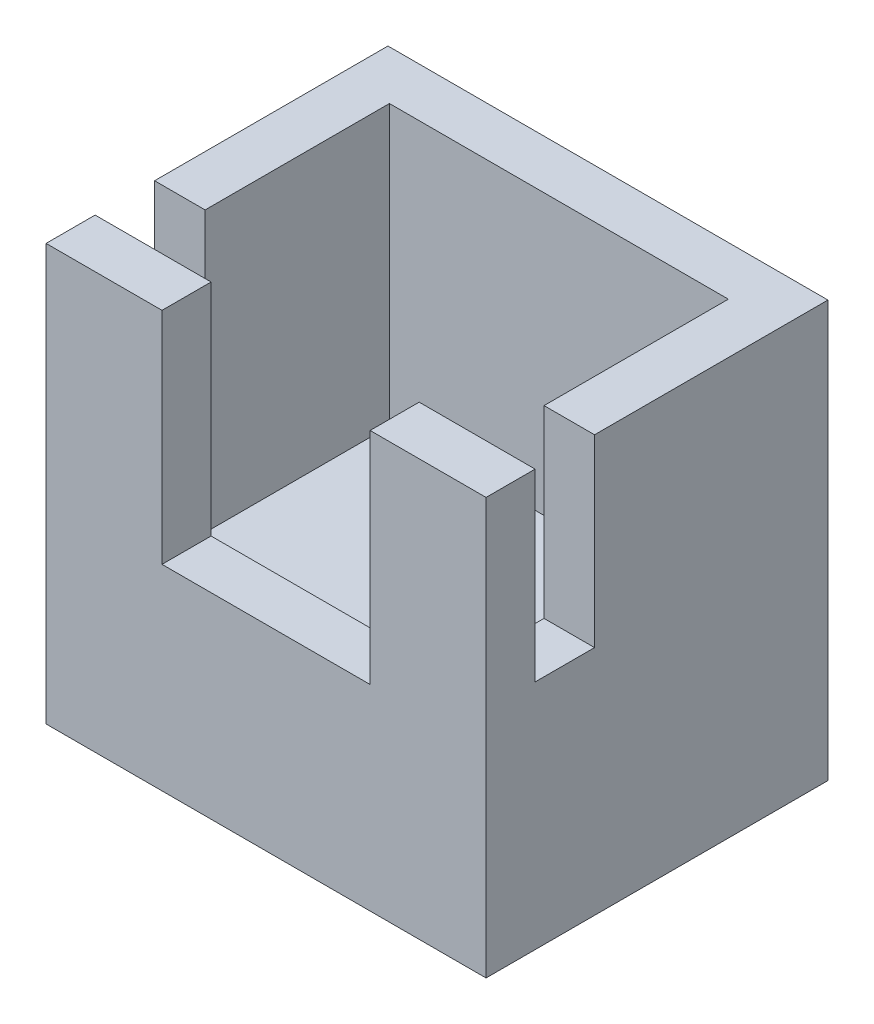
ISO-10303-21;
HEADER;
FILE_DESCRIPTION(('STEP AP214'),'2;1');
FILE_NAME('part.step','',(''),(''),'','','');
FILE_SCHEMA(('AUTOMOTIVE_DESIGN { 1 0 10303 214 1 1 1 1 }'));
ENDSEC;
DATA;
#1=APPLICATION_CONTEXT('core data for automotive mechanical design processes');
#2=APPLICATION_PROTOCOL_DEFINITION('international standard','automotive_design',2000,#1);
#3=PRODUCT_CONTEXT('',#1,'mechanical');
#4=PRODUCT('Part','Part','',(#3));
#5=PRODUCT_RELATED_PRODUCT_CATEGORY('part','',(#4));
#6=PRODUCT_DEFINITION_FORMATION('','',#4);
#7=PRODUCT_DEFINITION_CONTEXT('part definition',#1,'design');
#8=PRODUCT_DEFINITION('design','',#6,#7);
#9=PRODUCT_DEFINITION_SHAPE('','',#8);
#10=(LENGTH_UNIT() NAMED_UNIT(*) SI_UNIT(.MILLI.,.METRE.));
#11=(NAMED_UNIT(*) PLANE_ANGLE_UNIT() SI_UNIT($,.RADIAN.));
#12=(NAMED_UNIT(*) SI_UNIT($,.STERADIAN.) SOLID_ANGLE_UNIT());
#13=UNCERTAINTY_MEASURE_WITH_UNIT(LENGTH_MEASURE(1.E-05),#10,'distance_accuracy_value','');
#14=(GEOMETRIC_REPRESENTATION_CONTEXT(3) GLOBAL_UNCERTAINTY_ASSIGNED_CONTEXT((#13)) GLOBAL_UNIT_ASSIGNED_CONTEXT((#10,
#11,#12)) REPRESENTATION_CONTEXT('',''));
#15=CARTESIAN_POINT('',(0.,0.,0.));
#16=DIRECTION('',(0.,0.,1.));
#17=DIRECTION('',(1.,0.,0.));
#18=AXIS2_PLACEMENT_3D('',#15,#16,#17);
#19=CARTESIAN_POINT('',(3.7,7.,-2.875));
#20=DIRECTION('',(0.,1.,0.));
#21=DIRECTION('',(0.,0.,1.));
#22=AXIS2_PLACEMENT_3D('',#19,#20,#21);
#23=PLANE('',#22);
#24=DIRECTION('',(0.,0.,-1.));
#25=VECTOR('',#24,1.);
#26=CARTESIAN_POINT('',(-1.75,7.,2.875));
#27=LINE('',#26,#25);
#28=CARTESIAN_POINT('',(-1.75,7.,2.875));
#29=VERTEX_POINT('',#28);
#30=CARTESIAN_POINT('',(-1.75,7.,2.05));
#31=VERTEX_POINT('',#30);
#32=EDGE_CURVE('E11',#29,#31,#27,.T.);
#33=ORIENTED_EDGE('',*,*,#32,.T.);
#34=DIRECTION('',(-1.,0.,0.));
#35=VECTOR('',#34,1.);
#36=CARTESIAN_POINT('',(3.7,7.,2.05));
#37=LINE('',#36,#35);
#38=CARTESIAN_POINT('',(-3.7,7.,2.05));
#39=VERTEX_POINT('',#38);
#40=EDGE_CURVE('E24',#31,#39,#37,.T.);
#41=ORIENTED_EDGE('',*,*,#40,.T.);
#42=DIRECTION('',(0.,0.,1.));
#43=VECTOR('',#42,1.);
#44=CARTESIAN_POINT('',(-3.7,7.,-2.875));
#45=LINE('',#44,#43);
#46=CARTESIAN_POINT('',(-3.7,7.,2.875));
#47=VERTEX_POINT('',#46);
#48=EDGE_CURVE('E291',#39,#47,#45,.T.);
#49=ORIENTED_EDGE('',*,*,#48,.T.);
#50=DIRECTION('',(-1.,0.,0.));
#51=VECTOR('',#50,1.);
#52=CARTESIAN_POINT('',(3.7,7.,2.875));
#53=LINE('',#52,#51);
#54=EDGE_CURVE('E288',#29,#47,#53,.T.);
#55=ORIENTED_EDGE('',*,*,#54,.F.);
#56=EDGE_LOOP('',(#33,#41,#49,#55));
#57=FACE_BOUND('',#56,.T.);
#58=ADVANCED_FACE('F17',(#57),#23,.T.);
#59=CARTESIAN_POINT('',(3.7,7.,1.05));
#60=DIRECTION('',(0.,0.,-1.));
#61=DIRECTION('',(-1.,0.,0.));
#62=AXIS2_PLACEMENT_3D('',#59,#60,#61);
#63=PLANE('',#62);
#64=DIRECTION('',(-1.,0.,0.));
#65=VECTOR('',#64,1.);
#66=CARTESIAN_POINT('',(3.7,7.,1.05));
#67=LINE('',#66,#65);
#68=CARTESIAN_POINT('',(3.7,7.,1.05));
#69=VERTEX_POINT('',#68);
#70=CARTESIAN_POINT('',(2.85,7.,1.05));
#71=VERTEX_POINT('',#70);
#72=EDGE_CURVE('E286',#69,#71,#67,.T.);
#73=ORIENTED_EDGE('',*,*,#72,.T.);
#74=DIRECTION('',(0.,1.,0.));
#75=VECTOR('',#74,1.);
#76=CARTESIAN_POINT('',(2.85,2.3,1.05));
#77=LINE('',#76,#75);
#78=CARTESIAN_POINT('',(2.85,3.9,1.05));
#79=VERTEX_POINT('',#78);
#80=EDGE_CURVE('E283',#79,#71,#77,.T.);
#81=ORIENTED_EDGE('',*,*,#80,.F.);
#82=DIRECTION('',(-1.,0.,0.));
#83=VECTOR('',#82,1.);
#84=CARTESIAN_POINT('',(3.7,3.9,1.05));
#85=LINE('',#84,#83);
#86=CARTESIAN_POINT('',(3.7,3.9,1.05));
#87=VERTEX_POINT('',#86);
#88=EDGE_CURVE('E280',#87,#79,#85,.T.);
#89=ORIENTED_EDGE('',*,*,#88,.F.);
#90=DIRECTION('',(0.,-1.,0.));
#91=VECTOR('',#90,1.);
#92=CARTESIAN_POINT('',(3.7,7.,1.05));
#93=LINE('',#92,#91);
#94=EDGE_CURVE('E277',#69,#87,#93,.T.);
#95=ORIENTED_EDGE('',*,*,#94,.F.);
#96=EDGE_LOOP('',(#73,#81,#89,#95));
#97=FACE_BOUND('',#96,.T.);
#98=ADVANCED_FACE('F343',(#97),#63,.F.);
#99=CARTESIAN_POINT('',(3.7,3.9,1.05));
#100=DIRECTION('',(0.,-1.,0.));
#101=DIRECTION('',(0.,0.,-1.));
#102=AXIS2_PLACEMENT_3D('',#99,#100,#101);
#103=PLANE('',#102);
#104=ORIENTED_EDGE('',*,*,#88,.T.);
#105=DIRECTION('',(0.,0.,-1.));
#106=VECTOR('',#105,1.);
#107=CARTESIAN_POINT('',(2.85,3.9,2.05));
#108=LINE('',#107,#106);
#109=CARTESIAN_POINT('',(2.85,3.9,2.05));
#110=VERTEX_POINT('',#109);
#111=EDGE_CURVE('E274',#110,#79,#108,.T.);
#112=ORIENTED_EDGE('',*,*,#111,.F.);
#113=DIRECTION('',(-1.,0.,0.));
#114=VECTOR('',#113,1.);
#115=CARTESIAN_POINT('',(3.7,3.9,2.05));
#116=LINE('',#115,#114);
#117=CARTESIAN_POINT('',(3.7,3.9,2.05));
#118=VERTEX_POINT('',#117);
#119=EDGE_CURVE('E271',#118,#110,#116,.T.);
#120=ORIENTED_EDGE('',*,*,#119,.F.);
#121=DIRECTION('',(0.,0.,1.));
#122=VECTOR('',#121,1.);
#123=CARTESIAN_POINT('',(3.7,3.9,1.05));
#124=LINE('',#123,#122);
#125=EDGE_CURVE('E268',#87,#118,#124,.T.);
#126=ORIENTED_EDGE('',*,*,#125,.F.);
#127=EDGE_LOOP('',(#104,#112,#120,#126));
#128=FACE_BOUND('',#127,.T.);
#129=ADVANCED_FACE('F339',(#128),#103,.F.);
#130=CARTESIAN_POINT('',(3.7,7.,-2.875));
#131=DIRECTION('',(0.,1.,0.));
#132=DIRECTION('',(0.,0.,1.));
#133=AXIS2_PLACEMENT_3D('',#130,#131,#132);
#134=PLANE('',#133);
#135=DIRECTION('',(0.,0.,-1.));
#136=VECTOR('',#135,1.);
#137=CARTESIAN_POINT('',(1.75,7.,2.875));
#138=LINE('',#137,#136);
#139=CARTESIAN_POINT('',(1.75,7.,2.875));
#140=VERTEX_POINT('',#139);
#141=CARTESIAN_POINT('',(1.75,7.,2.05));
#142=VERTEX_POINT('',#141);
#143=EDGE_CURVE('E266',#140,#142,#138,.T.);
#144=ORIENTED_EDGE('',*,*,#143,.F.);
#145=DIRECTION('',(-1.,0.,0.));
#146=VECTOR('',#145,1.);
#147=CARTESIAN_POINT('',(3.7,7.,2.875));
#148=LINE('',#147,#146);
#149=CARTESIAN_POINT('',(3.7,7.,2.875));
#150=VERTEX_POINT('',#149);
#151=EDGE_CURVE('E263',#150,#140,#148,.T.);
#152=ORIENTED_EDGE('',*,*,#151,.F.);
#153=DIRECTION('',(0.,0.,1.));
#154=VECTOR('',#153,1.);
#155=CARTESIAN_POINT('',(3.7,7.,-2.875));
#156=LINE('',#155,#154);
#157=CARTESIAN_POINT('',(3.7,7.,2.05));
#158=VERTEX_POINT('',#157);
#159=EDGE_CURVE('E260',#158,#150,#156,.T.);
#160=ORIENTED_EDGE('',*,*,#159,.F.);
#161=DIRECTION('',(-1.,0.,0.));
#162=VECTOR('',#161,1.);
#163=CARTESIAN_POINT('',(3.7,7.,2.05));
#164=LINE('',#163,#162);
#165=EDGE_CURVE('E257',#158,#142,#164,.T.);
#166=ORIENTED_EDGE('',*,*,#165,.T.);
#167=EDGE_LOOP('',(#144,#152,#160,#166));
#168=FACE_BOUND('',#167,.T.);
#169=ADVANCED_FACE('F334',(#168),#134,.T.);
#170=CARTESIAN_POINT('',(-3.7,0.,-2.875));
#171=DIRECTION('',(0.,-1.,0.));
#172=DIRECTION('',(0.,0.,-1.));
#173=AXIS2_PLACEMENT_3D('',#170,#171,#172);
#174=PLANE('',#173);
#175=DIRECTION('',(1.,0.,0.));
#176=VECTOR('',#175,1.);
#177=CARTESIAN_POINT('',(-3.7,0.,2.875));
#178=LINE('',#177,#176);
#179=CARTESIAN_POINT('',(-3.7,0.,2.875));
#180=VERTEX_POINT('',#179);
#181=CARTESIAN_POINT('',(3.7,0.,2.875));
#182=VERTEX_POINT('',#181);
#183=EDGE_CURVE('E255',#180,#182,#178,.T.);
#184=ORIENTED_EDGE('',*,*,#183,.F.);
#185=DIRECTION('',(0.,0.,1.));
#186=VECTOR('',#185,1.);
#187=CARTESIAN_POINT('',(-3.7,0.,-2.875));
#188=LINE('',#187,#186);
#189=CARTESIAN_POINT('',(-3.7,0.,-2.875));
#190=VERTEX_POINT('',#189);
#191=EDGE_CURVE('E252',#190,#180,#188,.T.);
#192=ORIENTED_EDGE('',*,*,#191,.F.);
#193=DIRECTION('',(1.,0.,0.));
#194=VECTOR('',#193,1.);
#195=CARTESIAN_POINT('',(-3.7,0.,-2.875));
#196=LINE('',#195,#194);
#197=CARTESIAN_POINT('',(3.7,0.,-2.875));
#198=VERTEX_POINT('',#197);
#199=EDGE_CURVE('E250',#190,#198,#196,.T.);
#200=ORIENTED_EDGE('',*,*,#199,.T.);
#201=DIRECTION('',(0.,0.,1.));
#202=VECTOR('',#201,1.);
#203=CARTESIAN_POINT('',(3.7,0.,-2.875));
#204=LINE('',#203,#202);
#205=EDGE_CURVE('E247',#198,#182,#204,.T.);
#206=ORIENTED_EDGE('',*,*,#205,.T.);
#207=EDGE_LOOP('',(#184,#192,#200,#206));
#208=FACE_BOUND('',#207,.T.);
#209=ADVANCED_FACE('F318',(#208),#174,.T.);
#210=CARTESIAN_POINT('',(-3.7,7.,-2.875));
#211=DIRECTION('',(-1.,0.,0.));
#212=DIRECTION('',(0.,0.,1.));
#213=AXIS2_PLACEMENT_3D('',#210,#211,#212);
#214=PLANE('',#213);
#215=DIRECTION('',(0.,1.,0.));
#216=VECTOR('',#215,1.);
#217=CARTESIAN_POINT('',(-3.7,3.9,2.05));
#218=LINE('',#217,#216);
#219=CARTESIAN_POINT('',(-3.7,3.9,2.05));
#220=VERTEX_POINT('',#219);
#221=EDGE_CURVE('E244',#220,#39,#218,.T.);
#222=ORIENTED_EDGE('',*,*,#221,.F.);
#223=DIRECTION('',(0.,0.,1.));
#224=VECTOR('',#223,1.);
#225=CARTESIAN_POINT('',(-3.7,3.9,1.05));
#226=LINE('',#225,#224);
#227=CARTESIAN_POINT('',(-3.7,3.9,1.05));
#228=VERTEX_POINT('',#227);
#229=EDGE_CURVE('E241',#228,#220,#226,.T.);
#230=ORIENTED_EDGE('',*,*,#229,.F.);
#231=DIRECTION('',(0.,-1.,0.));
#232=VECTOR('',#231,1.);
#233=CARTESIAN_POINT('',(-3.7,7.,1.05));
#234=LINE('',#233,#232);
#235=CARTESIAN_POINT('',(-3.7,7.,1.05));
#236=VERTEX_POINT('',#235);
#237=EDGE_CURVE('E238',#236,#228,#234,.T.);
#238=ORIENTED_EDGE('',*,*,#237,.F.);
#239=DIRECTION('',(0.,0.,1.));
#240=VECTOR('',#239,1.);
#241=CARTESIAN_POINT('',(-3.7,7.,-2.875));
#242=LINE('',#241,#240);
#243=CARTESIAN_POINT('',(-3.7,7.,-2.875));
#244=VERTEX_POINT('',#243);
#245=EDGE_CURVE('E235',#244,#236,#242,.T.);
#246=ORIENTED_EDGE('',*,*,#245,.F.);
#247=DIRECTION('',(0.,-1.,0.));
#248=VECTOR('',#247,1.);
#249=CARTESIAN_POINT('',(-3.7,7.,-2.875));
#250=LINE('',#249,#248);
#251=EDGE_CURVE('E232',#244,#190,#250,.T.);
#252=ORIENTED_EDGE('',*,*,#251,.T.);
#253=ORIENTED_EDGE('',*,*,#191,.T.);
#254=DIRECTION('',(0.,-1.,0.));
#255=VECTOR('',#254,1.);
#256=CARTESIAN_POINT('',(-3.7,7.,2.875));
#257=LINE('',#256,#255);
#258=EDGE_CURVE('E229',#47,#180,#257,.T.);
#259=ORIENTED_EDGE('',*,*,#258,.F.);
#260=ORIENTED_EDGE('',*,*,#48,.F.);
#261=EDGE_LOOP('',(#222,#230,#238,#246,#252,#253,#259,#260));
#262=FACE_BOUND('',#261,.T.);
#263=ADVANCED_FACE('F296',(#262),#214,.T.);
#264=CARTESIAN_POINT('',(3.7,7.,-2.875));
#265=DIRECTION('',(0.,1.,0.));
#266=DIRECTION('',(0.,0.,1.));
#267=AXIS2_PLACEMENT_3D('',#264,#265,#266);
#268=PLANE('',#267);
#269=DIRECTION('',(0.,0.,1.));
#270=VECTOR('',#269,1.);
#271=CARTESIAN_POINT('',(2.85,7.,-2.05));
#272=LINE('',#271,#270);
#273=CARTESIAN_POINT('',(2.85,7.,-2.05));
#274=VERTEX_POINT('',#273);
#275=EDGE_CURVE('E226',#274,#71,#272,.T.);
#276=ORIENTED_EDGE('',*,*,#275,.T.);
#277=ORIENTED_EDGE('',*,*,#72,.F.);
#278=DIRECTION('',(0.,0.,1.));
#279=VECTOR('',#278,1.);
#280=CARTESIAN_POINT('',(3.7,7.,-2.875));
#281=LINE('',#280,#279);
#282=CARTESIAN_POINT('',(3.7,7.,-2.875));
#283=VERTEX_POINT('',#282);
#284=EDGE_CURVE('E223',#283,#69,#281,.T.);
#285=ORIENTED_EDGE('',*,*,#284,.F.);
#286=DIRECTION('',(-1.,0.,0.));
#287=VECTOR('',#286,1.);
#288=CARTESIAN_POINT('',(3.7,7.,-2.875));
#289=LINE('',#288,#287);
#290=EDGE_CURVE('E220',#283,#244,#289,.T.);
#291=ORIENTED_EDGE('',*,*,#290,.T.);
#292=ORIENTED_EDGE('',*,*,#245,.T.);
#293=DIRECTION('',(-1.,0.,0.));
#294=VECTOR('',#293,1.);
#295=CARTESIAN_POINT('',(3.7,7.,1.05));
#296=LINE('',#295,#294);
#297=CARTESIAN_POINT('',(-2.85,7.,1.05));
#298=VERTEX_POINT('',#297);
#299=EDGE_CURVE('E217',#298,#236,#296,.T.);
#300=ORIENTED_EDGE('',*,*,#299,.F.);
#301=DIRECTION('',(0.,0.,1.));
#302=VECTOR('',#301,1.);
#303=CARTESIAN_POINT('',(-2.85,7.,-2.05));
#304=LINE('',#303,#302);
#305=CARTESIAN_POINT('',(-2.85,7.,-2.05));
#306=VERTEX_POINT('',#305);
#307=EDGE_CURVE('E215',#306,#298,#304,.T.);
#308=ORIENTED_EDGE('',*,*,#307,.F.);
#309=DIRECTION('',(-1.,0.,0.));
#310=VECTOR('',#309,1.);
#311=CARTESIAN_POINT('',(2.85,7.,-2.05));
#312=LINE('',#311,#310);
#313=EDGE_CURVE('E157',#274,#306,#312,.T.);
#314=ORIENTED_EDGE('',*,*,#313,.F.);
#315=EDGE_LOOP('',(#276,#277,#285,#291,#292,#300,#308,#314));
#316=FACE_BOUND('',#315,.T.);
#317=ADVANCED_FACE('F307',(#316),#268,.T.);
#318=CARTESIAN_POINT('',(3.7,0.,-2.875));
#319=DIRECTION('',(1.,0.,0.));
#320=DIRECTION('',(0.,0.,-1.));
#321=AXIS2_PLACEMENT_3D('',#318,#319,#320);
#322=PLANE('',#321);
#323=DIRECTION('',(0.,1.,0.));
#324=VECTOR('',#323,1.);
#325=CARTESIAN_POINT('',(3.7,3.9,2.05));
#326=LINE('',#325,#324);
#327=EDGE_CURVE('E211',#118,#158,#326,.T.);
#328=ORIENTED_EDGE('',*,*,#327,.T.);
#329=ORIENTED_EDGE('',*,*,#159,.T.);
#330=DIRECTION('',(0.,1.,0.));
#331=VECTOR('',#330,1.);
#332=CARTESIAN_POINT('',(3.7,0.,2.875));
#333=LINE('',#332,#331);
#334=EDGE_CURVE('E208',#182,#150,#333,.T.);
#335=ORIENTED_EDGE('',*,*,#334,.F.);
#336=ORIENTED_EDGE('',*,*,#205,.F.);
#337=DIRECTION('',(0.,1.,0.));
#338=VECTOR('',#337,1.);
#339=CARTESIAN_POINT('',(3.7,0.,-2.875));
#340=LINE('',#339,#338);
#341=EDGE_CURVE('E205',#198,#283,#340,.T.);
#342=ORIENTED_EDGE('',*,*,#341,.T.);
#343=ORIENTED_EDGE('',*,*,#284,.T.);
#344=ORIENTED_EDGE('',*,*,#94,.T.);
#345=ORIENTED_EDGE('',*,*,#125,.T.);
#346=EDGE_LOOP('',(#328,#329,#335,#336,#342,#343,#344,#345));
#347=FACE_BOUND('',#346,.T.);
#348=ADVANCED_FACE('F315',(#347),#322,.T.);
#349=CARTESIAN_POINT('',(0.,0.,-2.875));
#350=DIRECTION('',(0.,0.,1.));
#351=DIRECTION('',(1.,0.,0.));
#352=AXIS2_PLACEMENT_3D('',#349,#350,#351);
#353=PLANE('',#352);
#354=ORIENTED_EDGE('',*,*,#199,.F.);
#355=ORIENTED_EDGE('',*,*,#251,.F.);
#356=ORIENTED_EDGE('',*,*,#290,.F.);
#357=ORIENTED_EDGE('',*,*,#341,.F.);
#358=EDGE_LOOP('',(#354,#355,#356,#357));
#359=FACE_BOUND('',#358,.T.);
#360=ADVANCED_FACE('F312',(#359),#353,.F.);
#361=CARTESIAN_POINT('',(0.,0.,2.875));
#362=DIRECTION('',(0.,0.,1.));
#363=DIRECTION('',(1.,0.,0.));
#364=AXIS2_PLACEMENT_3D('',#361,#362,#363);
#365=PLANE('',#364);
#366=DIRECTION('',(0.,1.,0.));
#367=VECTOR('',#366,1.);
#368=CARTESIAN_POINT('',(-1.75,3.3,2.875));
#369=LINE('',#368,#367);
#370=CARTESIAN_POINT('',(-1.75,3.3,2.875));
#371=VERTEX_POINT('',#370);
#372=EDGE_CURVE('E202',#371,#29,#369,.T.);
#373=ORIENTED_EDGE('',*,*,#372,.T.);
#374=ORIENTED_EDGE('',*,*,#54,.T.);
#375=ORIENTED_EDGE('',*,*,#258,.T.);
#376=ORIENTED_EDGE('',*,*,#183,.T.);
#377=ORIENTED_EDGE('',*,*,#334,.T.);
#378=ORIENTED_EDGE('',*,*,#151,.T.);
#379=DIRECTION('',(0.,-1.,0.));
#380=VECTOR('',#379,1.);
#381=CARTESIAN_POINT('',(1.75,7.,2.875));
#382=LINE('',#381,#380);
#383=CARTESIAN_POINT('',(1.75,3.3,2.875));
#384=VERTEX_POINT('',#383);
#385=EDGE_CURVE('E200',#140,#384,#382,.T.);
#386=ORIENTED_EDGE('',*,*,#385,.T.);
#387=DIRECTION('',(-1.,0.,0.));
#388=VECTOR('',#387,1.);
#389=CARTESIAN_POINT('',(1.75,3.3,2.875));
#390=LINE('',#389,#388);
#391=EDGE_CURVE('E197',#384,#371,#390,.T.);
#392=ORIENTED_EDGE('',*,*,#391,.T.);
#393=EDGE_LOOP('',(#373,#374,#375,#376,#377,#378,#386,#392));
#394=FACE_BOUND('',#393,.T.);
#395=ADVANCED_FACE('F320',(#394),#365,.T.);
#396=CARTESIAN_POINT('',(3.7,3.9,2.05));
#397=DIRECTION('',(0.,0.,1.));
#398=DIRECTION('',(0.,-1.,0.));
#399=AXIS2_PLACEMENT_3D('',#396,#397,#398);
#400=PLANE('',#399);
#401=ORIENTED_EDGE('',*,*,#40,.F.);
#402=DIRECTION('',(0.,1.,0.));
#403=VECTOR('',#402,1.);
#404=CARTESIAN_POINT('',(-1.75,3.3,2.05));
#405=LINE('',#404,#403);
#406=CARTESIAN_POINT('',(-1.75,3.3,2.05));
#407=VERTEX_POINT('',#406);
#408=EDGE_CURVE('E195',#407,#31,#405,.T.);
#409=ORIENTED_EDGE('',*,*,#408,.F.);
#410=DIRECTION('',(-1.,0.,0.));
#411=VECTOR('',#410,1.);
#412=CARTESIAN_POINT('',(1.75,3.3,2.05));
#413=LINE('',#412,#411);
#414=CARTESIAN_POINT('',(1.75,3.3,2.05));
#415=VERTEX_POINT('',#414);
#416=EDGE_CURVE('E192',#415,#407,#413,.T.);
#417=ORIENTED_EDGE('',*,*,#416,.F.);
#418=DIRECTION('',(0.,-1.,0.));
#419=VECTOR('',#418,1.);
#420=CARTESIAN_POINT('',(1.75,7.,2.05));
#421=LINE('',#420,#419);
#422=EDGE_CURVE('E189',#142,#415,#421,.T.);
#423=ORIENTED_EDGE('',*,*,#422,.F.);
#424=ORIENTED_EDGE('',*,*,#165,.F.);
#425=ORIENTED_EDGE('',*,*,#327,.F.);
#426=ORIENTED_EDGE('',*,*,#119,.T.);
#427=DIRECTION('',(0.,1.,0.));
#428=VECTOR('',#427,1.);
#429=CARTESIAN_POINT('',(2.85,2.3,2.05));
#430=LINE('',#429,#428);
#431=CARTESIAN_POINT('',(2.85,2.3,2.05));
#432=VERTEX_POINT('',#431);
#433=EDGE_CURVE('E186',#432,#110,#430,.T.);
#434=ORIENTED_EDGE('',*,*,#433,.F.);
#435=DIRECTION('',(1.,0.,0.));
#436=VECTOR('',#435,1.);
#437=CARTESIAN_POINT('',(-2.85,2.3,2.05));
#438=LINE('',#437,#436);
#439=CARTESIAN_POINT('',(-2.85,2.3,2.05));
#440=VERTEX_POINT('',#439);
#441=EDGE_CURVE('E184',#440,#432,#438,.T.);
#442=ORIENTED_EDGE('',*,*,#441,.F.);
#443=DIRECTION('',(0.,1.,0.));
#444=VECTOR('',#443,1.);
#445=CARTESIAN_POINT('',(-2.85,2.3,2.05));
#446=LINE('',#445,#444);
#447=CARTESIAN_POINT('',(-2.85,3.9,2.05));
#448=VERTEX_POINT('',#447);
#449=EDGE_CURVE('E144',#440,#448,#446,.T.);
#450=ORIENTED_EDGE('',*,*,#449,.T.);
#451=DIRECTION('',(-1.,0.,0.));
#452=VECTOR('',#451,1.);
#453=CARTESIAN_POINT('',(3.7,3.9,2.05));
#454=LINE('',#453,#452);
#455=EDGE_CURVE('E180',#448,#220,#454,.T.);
#456=ORIENTED_EDGE('',*,*,#455,.T.);
#457=ORIENTED_EDGE('',*,*,#221,.T.);
#458=EDGE_LOOP('',(#401,#409,#417,#423,#424,#425,#426,#434,#442,#450,#456,#457));
#459=FACE_BOUND('',#458,.T.);
#460=ADVANCED_FACE('F297',(#459),#400,.F.);
#461=CARTESIAN_POINT('',(3.7,3.9,1.05));
#462=DIRECTION('',(0.,-1.,0.));
#463=DIRECTION('',(0.,0.,-1.));
#464=AXIS2_PLACEMENT_3D('',#461,#462,#463);
#465=PLANE('',#464);
#466=ORIENTED_EDGE('',*,*,#455,.F.);
#467=DIRECTION('',(0.,0.,1.));
#468=VECTOR('',#467,1.);
#469=CARTESIAN_POINT('',(-2.85,3.9,1.05));
#470=LINE('',#469,#468);
#471=CARTESIAN_POINT('',(-2.85,3.9,1.05));
#472=VERTEX_POINT('',#471);
#473=EDGE_CURVE('E178',#472,#448,#470,.T.);
#474=ORIENTED_EDGE('',*,*,#473,.F.);
#475=DIRECTION('',(-1.,0.,0.));
#476=VECTOR('',#475,1.);
#477=CARTESIAN_POINT('',(3.7,3.9,1.05));
#478=LINE('',#477,#476);
#479=EDGE_CURVE('E175',#472,#228,#478,.T.);
#480=ORIENTED_EDGE('',*,*,#479,.T.);
#481=ORIENTED_EDGE('',*,*,#229,.T.);
#482=EDGE_LOOP('',(#466,#474,#480,#481));
#483=FACE_BOUND('',#482,.T.);
#484=ADVANCED_FACE('F300',(#483),#465,.F.);
#485=CARTESIAN_POINT('',(3.7,7.,1.05));
#486=DIRECTION('',(0.,0.,-1.));
#487=DIRECTION('',(-1.,0.,0.));
#488=AXIS2_PLACEMENT_3D('',#485,#486,#487);
#489=PLANE('',#488);
#490=ORIENTED_EDGE('',*,*,#479,.F.);
#491=DIRECTION('',(0.,-1.,0.));
#492=VECTOR('',#491,1.);
#493=CARTESIAN_POINT('',(-2.85,7.,1.05));
#494=LINE('',#493,#492);
#495=EDGE_CURVE('E172',#298,#472,#494,.T.);
#496=ORIENTED_EDGE('',*,*,#495,.F.);
#497=ORIENTED_EDGE('',*,*,#299,.T.);
#498=ORIENTED_EDGE('',*,*,#237,.T.);
#499=EDGE_LOOP('',(#490,#496,#497,#498));
#500=FACE_BOUND('',#499,.T.);
#501=ADVANCED_FACE('F304',(#500),#489,.F.);
#502=CARTESIAN_POINT('',(2.85,2.3,2.05));
#503=DIRECTION('',(1.,0.,0.));
#504=DIRECTION('',(0.,0.,-1.));
#505=AXIS2_PLACEMENT_3D('',#502,#503,#504);
#506=PLANE('',#505);
#507=ORIENTED_EDGE('',*,*,#111,.T.);
#508=ORIENTED_EDGE('',*,*,#80,.T.);
#509=ORIENTED_EDGE('',*,*,#275,.F.);
#510=DIRECTION('',(0.,1.,0.));
#511=VECTOR('',#510,1.);
#512=CARTESIAN_POINT('',(2.85,2.3,-2.05));
#513=LINE('',#512,#511);
#514=CARTESIAN_POINT('',(2.85,2.3,-2.05));
#515=VERTEX_POINT('',#514);
#516=EDGE_CURVE('E170',#515,#274,#513,.T.);
#517=ORIENTED_EDGE('',*,*,#516,.F.);
#518=DIRECTION('',(0.,0.,-1.));
#519=VECTOR('',#518,1.);
#520=CARTESIAN_POINT('',(2.85,2.3,2.05));
#521=LINE('',#520,#519);
#522=EDGE_CURVE('E148',#432,#515,#521,.T.);
#523=ORIENTED_EDGE('',*,*,#522,.F.);
#524=ORIENTED_EDGE('',*,*,#433,.T.);
#525=EDGE_LOOP('',(#507,#508,#509,#517,#523,#524));
#526=FACE_BOUND('',#525,.T.);
#527=ADVANCED_FACE('F341',(#526),#506,.F.);
#528=CARTESIAN_POINT('',(-2.85,2.3,1.05));
#529=DIRECTION('',(-1.,0.,0.));
#530=DIRECTION('',(0.,0.,1.));
#531=AXIS2_PLACEMENT_3D('',#528,#529,#530);
#532=PLANE('',#531);
#533=ORIENTED_EDGE('',*,*,#473,.T.);
#534=ORIENTED_EDGE('',*,*,#449,.F.);
#535=DIRECTION('',(0.,0.,1.));
#536=VECTOR('',#535,1.);
#537=CARTESIAN_POINT('',(-2.85,2.3,1.05));
#538=LINE('',#537,#536);
#539=CARTESIAN_POINT('',(-2.85,2.3,-2.05));
#540=VERTEX_POINT('',#539);
#541=EDGE_CURVE('E138',#540,#440,#538,.T.);
#542=ORIENTED_EDGE('',*,*,#541,.F.);
#543=DIRECTION('',(0.,-1.,0.));
#544=VECTOR('',#543,1.);
#545=CARTESIAN_POINT('',(-2.85,7.,-2.05));
#546=LINE('',#545,#544);
#547=EDGE_CURVE('E143',#306,#540,#546,.T.);
#548=ORIENTED_EDGE('',*,*,#547,.F.);
#549=ORIENTED_EDGE('',*,*,#307,.T.);
#550=ORIENTED_EDGE('',*,*,#495,.T.);
#551=EDGE_LOOP('',(#533,#534,#542,#548,#549,#550));
#552=FACE_BOUND('',#551,.T.);
#553=ADVANCED_FACE('F141',(#552),#532,.F.);
#554=CARTESIAN_POINT('',(0.,2.3,0.));
#555=DIRECTION('',(0.,1.,0.));
#556=DIRECTION('',(0.,0.,1.));
#557=AXIS2_PLACEMENT_3D('',#554,#555,#556);
#558=PLANE('',#557);
#559=ORIENTED_EDGE('',*,*,#522,.T.);
#560=DIRECTION('',(1.,0.,0.));
#561=VECTOR('',#560,1.);
#562=CARTESIAN_POINT('',(-2.85,2.3,-2.05));
#563=LINE('',#562,#561);
#564=EDGE_CURVE('E155',#540,#515,#563,.T.);
#565=ORIENTED_EDGE('',*,*,#564,.F.);
#566=ORIENTED_EDGE('',*,*,#541,.T.);
#567=ORIENTED_EDGE('',*,*,#441,.T.);
#568=EDGE_LOOP('',(#559,#565,#566,#567));
#569=FACE_BOUND('',#568,.T.);
#570=ADVANCED_FACE('F160',(#569),#558,.T.);
#571=CARTESIAN_POINT('',(0.,0.,-2.05));
#572=DIRECTION('',(0.,0.,1.));
#573=DIRECTION('',(1.,0.,0.));
#574=AXIS2_PLACEMENT_3D('',#571,#572,#573);
#575=PLANE('',#574);
#576=ORIENTED_EDGE('',*,*,#313,.T.);
#577=ORIENTED_EDGE('',*,*,#547,.T.);
#578=ORIENTED_EDGE('',*,*,#564,.T.);
#579=ORIENTED_EDGE('',*,*,#516,.T.);
#580=EDGE_LOOP('',(#576,#577,#578,#579));
#581=FACE_BOUND('',#580,.T.);
#582=ADVANCED_FACE('F153',(#581),#575,.T.);
#583=CARTESIAN_POINT('',(-1.75,3.3,2.875));
#584=DIRECTION('',(-1.,0.,0.));
#585=DIRECTION('',(0.,0.,1.));
#586=AXIS2_PLACEMENT_3D('',#583,#584,#585);
#587=PLANE('',#586);
#588=ORIENTED_EDGE('',*,*,#408,.T.);
#589=ORIENTED_EDGE('',*,*,#32,.F.);
#590=ORIENTED_EDGE('',*,*,#372,.F.);
#591=DIRECTION('',(0.,0.,-1.));
#592=VECTOR('',#591,1.);
#593=CARTESIAN_POINT('',(-1.75,3.3,2.875));
#594=LINE('',#593,#592);
#595=EDGE_CURVE('E162',#371,#407,#594,.T.);
#596=ORIENTED_EDGE('',*,*,#595,.T.);
#597=EDGE_LOOP('',(#588,#589,#590,#596));
#598=FACE_BOUND('',#597,.T.);
#599=ADVANCED_FACE('F323',(#598),#587,.F.);
#600=CARTESIAN_POINT('',(1.75,3.3,2.875));
#601=DIRECTION('',(0.,-1.,0.));
#602=DIRECTION('',(0.,0.,-1.));
#603=AXIS2_PLACEMENT_3D('',#600,#601,#602);
#604=PLANE('',#603);
#605=ORIENTED_EDGE('',*,*,#416,.T.);
#606=ORIENTED_EDGE('',*,*,#595,.F.);
#607=ORIENTED_EDGE('',*,*,#391,.F.);
#608=DIRECTION('',(0.,0.,-1.));
#609=VECTOR('',#608,1.);
#610=CARTESIAN_POINT('',(1.75,3.3,2.875));
#611=LINE('',#610,#609);
#612=EDGE_CURVE('E165',#384,#415,#611,.T.);
#613=ORIENTED_EDGE('',*,*,#612,.T.);
#614=EDGE_LOOP('',(#605,#606,#607,#613));
#615=FACE_BOUND('',#614,.T.);
#616=ADVANCED_FACE('F325',(#615),#604,.F.);
#617=CARTESIAN_POINT('',(1.75,7.,2.875));
#618=DIRECTION('',(1.,0.,0.));
#619=DIRECTION('',(0.,0.,-1.));
#620=AXIS2_PLACEMENT_3D('',#617,#618,#619);
#621=PLANE('',#620);
#622=ORIENTED_EDGE('',*,*,#422,.T.);
#623=ORIENTED_EDGE('',*,*,#612,.F.);
#624=ORIENTED_EDGE('',*,*,#385,.F.);
#625=ORIENTED_EDGE('',*,*,#143,.T.);
#626=EDGE_LOOP('',(#622,#623,#624,#625));
#627=FACE_BOUND('',#626,.T.);
#628=ADVANCED_FACE('F331',(#627),#621,.F.);
#629=CLOSED_SHELL('',(#58,#98,#129,#169,#209,#263,#317,#348,#360,#395,#460,#484,#501,#527,#553,
#570,#582,#599,#616,#628));
#630=MANIFOLD_SOLID_BREP('B1',#629);
#631=ADVANCED_BREP_SHAPE_REPRESENTATION('',(#18,#630),#14);
#632=SHAPE_DEFINITION_REPRESENTATION(#9,#631);
ENDSEC;
END-ISO-10303-21;
